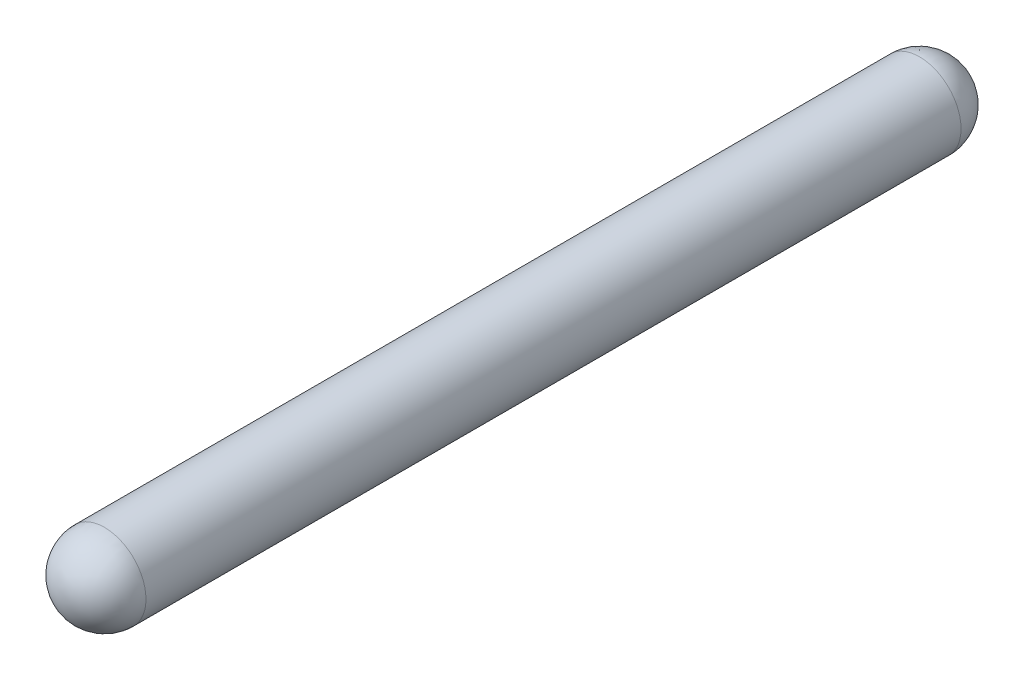
ISO-10303-21;
HEADER;
FILE_DESCRIPTION(('STEP AP214'),'2;1');
FILE_NAME('part.step','',(''),(''),'','','');
FILE_SCHEMA(('AUTOMOTIVE_DESIGN { 1 0 10303 214 1 1 1 1 }'));
ENDSEC;
DATA;
#1=APPLICATION_CONTEXT('core data for automotive mechanical design processes');
#2=APPLICATION_PROTOCOL_DEFINITION('international standard','automotive_design',2000,#1);
#3=PRODUCT_CONTEXT('',#1,'mechanical');
#4=PRODUCT('Part','Part','',(#3));
#5=PRODUCT_RELATED_PRODUCT_CATEGORY('part','',(#4));
#6=PRODUCT_DEFINITION_FORMATION('','',#4);
#7=PRODUCT_DEFINITION_CONTEXT('part definition',#1,'design');
#8=PRODUCT_DEFINITION('design','',#6,#7);
#9=PRODUCT_DEFINITION_SHAPE('','',#8);
#10=(LENGTH_UNIT() NAMED_UNIT(*) SI_UNIT(.MILLI.,.METRE.));
#11=(NAMED_UNIT(*) PLANE_ANGLE_UNIT() SI_UNIT($,.RADIAN.));
#12=(NAMED_UNIT(*) SI_UNIT($,.STERADIAN.) SOLID_ANGLE_UNIT());
#13=UNCERTAINTY_MEASURE_WITH_UNIT(LENGTH_MEASURE(1.E-05),#10,'distance_accuracy_value','');
#14=(GEOMETRIC_REPRESENTATION_CONTEXT(3) GLOBAL_UNCERTAINTY_ASSIGNED_CONTEXT((#13)) GLOBAL_UNIT_ASSIGNED_CONTEXT((#10,
#11,#12)) REPRESENTATION_CONTEXT('',''));
#15=CARTESIAN_POINT('',(0.,0.,0.));
#16=DIRECTION('',(0.,0.,1.));
#17=DIRECTION('',(1.,0.,0.));
#18=AXIS2_PLACEMENT_3D('',#15,#16,#17);
#19=CARTESIAN_POINT('',(0.,-2.54,-3.));
#20=DIRECTION('',(1.,0.,0.));
#21=DIRECTION('',(0.,-1.,0.));
#22=AXIS2_PLACEMENT_3D('',#19,#20,#21);
#23=SPHERICAL_SURFACE('',#22,0.331);
#24=CARTESIAN_POINT('',(0.,-2.54,-3.));
#25=DIRECTION('',(0.,0.,1.));
#26=DIRECTION('',(1.,0.,0.));
#27=AXIS2_PLACEMENT_3D('',#24,#25,#26);
#28=CIRCLE('',#27,0.331);
#29=CARTESIAN_POINT('',(0.331,-2.54,-3.));
#30=VERTEX_POINT('',#29);
#31=CARTESIAN_POINT('',(-0.331,-2.54,-3.));
#32=VERTEX_POINT('',#31);
#33=EDGE_CURVE('E42',#30,#32,#28,.T.);
#34=ORIENTED_EDGE('',*,*,#33,.F.);
#35=CARTESIAN_POINT('',(0.,-2.54,-3.));
#36=DIRECTION('',(0.,0.,1.));
#37=DIRECTION('',(1.,0.,0.));
#38=AXIS2_PLACEMENT_3D('',#35,#36,#37);
#39=CIRCLE('',#38,0.331);
#40=EDGE_CURVE('E26',#32,#30,#39,.T.);
#41=ORIENTED_EDGE('',*,*,#40,.F.);
#42=EDGE_LOOP('',(#34,#41));
#43=FACE_BOUND('',#42,.T.);
#44=ADVANCED_FACE('F17',(#43),#23,.T.);
#45=CARTESIAN_POINT('',(0.,-2.54,3.5));
#46=DIRECTION('',(1.,0.,0.));
#47=DIRECTION('',(0.,1.,0.));
#48=AXIS2_PLACEMENT_3D('',#45,#46,#47);
#49=SPHERICAL_SURFACE('',#48,0.331);
#50=CARTESIAN_POINT('',(0.,-2.54,3.5));
#51=DIRECTION('',(0.,0.,1.));
#52=DIRECTION('',(1.,0.,0.));
#53=AXIS2_PLACEMENT_3D('',#50,#51,#52);
#54=CIRCLE('',#53,0.331);
#55=CARTESIAN_POINT('',(0.331,-2.54,3.5));
#56=VERTEX_POINT('',#55);
#57=CARTESIAN_POINT('',(-0.331,-2.54,3.5));
#58=VERTEX_POINT('',#57);
#59=EDGE_CURVE('E11',#56,#58,#54,.F.);
#60=ORIENTED_EDGE('',*,*,#59,.F.);
#61=CARTESIAN_POINT('',(0.,-2.54,3.5));
#62=DIRECTION('',(0.,0.,1.));
#63=DIRECTION('',(1.,0.,0.));
#64=AXIS2_PLACEMENT_3D('',#61,#62,#63);
#65=CIRCLE('',#64,0.331);
#66=EDGE_CURVE('E34',#58,#56,#65,.F.);
#67=ORIENTED_EDGE('',*,*,#66,.F.);
#68=EDGE_LOOP('',(#60,#67));
#69=FACE_BOUND('',#68,.T.);
#70=ADVANCED_FACE('F49',(#69),#49,.T.);
#71=CARTESIAN_POINT('',(0.,-2.54,-3.));
#72=DIRECTION('',(0.,0.,1.));
#73=DIRECTION('',(1.,0.,0.));
#74=AXIS2_PLACEMENT_3D('',#71,#72,#73);
#75=CYLINDRICAL_SURFACE('',#74,0.331);
#76=ORIENTED_EDGE('',*,*,#66,.T.);
#77=ORIENTED_EDGE('',*,*,#59,.T.);
#78=EDGE_LOOP('',(#76,#77));
#79=FACE_BOUND('',#78,.T.);
#80=ORIENTED_EDGE('',*,*,#40,.T.);
#81=ORIENTED_EDGE('',*,*,#33,.T.);
#82=EDGE_LOOP('',(#80,#81));
#83=FACE_BOUND('',#82,.T.);
#84=ADVANCED_FACE('F45',(#79,#83),#75,.T.);
#85=CLOSED_SHELL('',(#44,#70,#84));
#86=MANIFOLD_SOLID_BREP('B1',#85);
#87=ADVANCED_BREP_SHAPE_REPRESENTATION('',(#18,#86),#14);
#88=SHAPE_DEFINITION_REPRESENTATION(#9,#87);
ENDSEC;
END-ISO-10303-21;
